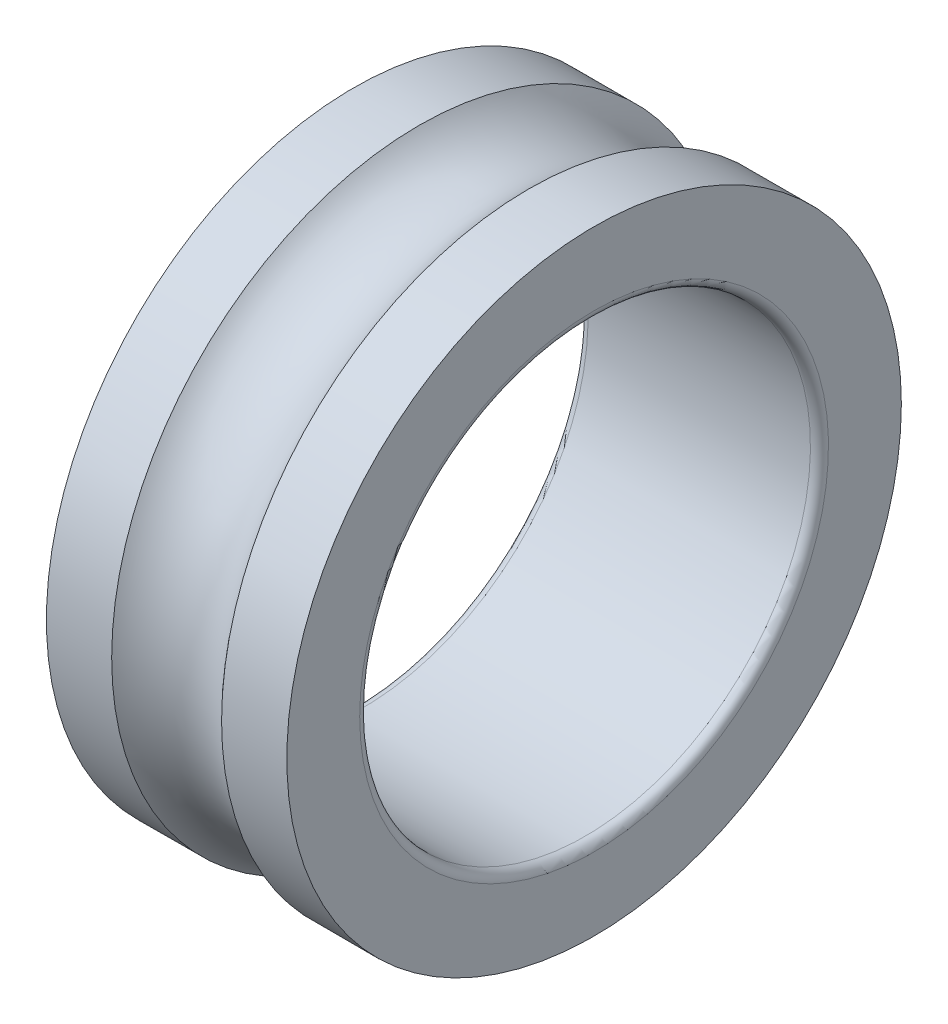
ISO-10303-21;
HEADER;
FILE_DESCRIPTION(('STEP AP214'),'2;1');
FILE_NAME('part.step','',(''),(''),'','','');
FILE_SCHEMA(('AUTOMOTIVE_DESIGN { 1 0 10303 214 1 1 1 1 }'));
ENDSEC;
DATA;
#1=APPLICATION_CONTEXT('core data for automotive mechanical design processes');
#2=APPLICATION_PROTOCOL_DEFINITION('international standard','automotive_design',2000,#1);
#3=PRODUCT_CONTEXT('',#1,'mechanical');
#4=PRODUCT('Part','Part','',(#3));
#5=PRODUCT_RELATED_PRODUCT_CATEGORY('part','',(#4));
#6=PRODUCT_DEFINITION_FORMATION('','',#4);
#7=PRODUCT_DEFINITION_CONTEXT('part definition',#1,'design');
#8=PRODUCT_DEFINITION('design','',#6,#7);
#9=PRODUCT_DEFINITION_SHAPE('','',#8);
#10=(LENGTH_UNIT() NAMED_UNIT(*) SI_UNIT(.MILLI.,.METRE.));
#11=(NAMED_UNIT(*) PLANE_ANGLE_UNIT() SI_UNIT($,.RADIAN.));
#12=(NAMED_UNIT(*) SI_UNIT($,.STERADIAN.) SOLID_ANGLE_UNIT());
#13=UNCERTAINTY_MEASURE_WITH_UNIT(LENGTH_MEASURE(1.E-05),#10,'distance_accuracy_value','');
#14=(GEOMETRIC_REPRESENTATION_CONTEXT(3) GLOBAL_UNCERTAINTY_ASSIGNED_CONTEXT((#13)) GLOBAL_UNIT_ASSIGNED_CONTEXT((#10,
#11,#12)) REPRESENTATION_CONTEXT('',''));
#15=CARTESIAN_POINT('',(0.,0.,0.));
#16=DIRECTION('',(0.,0.,1.));
#17=DIRECTION('',(1.,0.,0.));
#18=AXIS2_PLACEMENT_3D('',#15,#16,#17);
#19=CARTESIAN_POINT('',(0.3,0.,0.));
#20=DIRECTION('',(1.,0.,0.));
#21=DIRECTION('',(0.,0.,-1.));
#22=AXIS2_PLACEMENT_3D('',#19,#20,#21);
#23=CYLINDRICAL_SURFACE('',#22,7.5);
#24=CARTESIAN_POINT('',(0.3,0.,0.));
#25=DIRECTION('',(1.,0.,0.));
#26=DIRECTION('',(0.,1.,0.));
#27=AXIS2_PLACEMENT_3D('',#24,#25,#26);
#28=CIRCLE('',#27,7.5);
#29=CARTESIAN_POINT('',(0.3,7.5,0.));
#30=VERTEX_POINT('',#29);
#31=EDGE_CURVE('E67',#30,#30,#28,.T.);
#32=ORIENTED_EDGE('',*,*,#31,.F.);
#33=EDGE_LOOP('',(#32));
#34=FACE_BOUND('',#33,.T.);
#35=CARTESIAN_POINT('',(7.7,0.,0.));
#36=DIRECTION('',(1.,0.,0.));
#37=DIRECTION('',(0.,1.,0.));
#38=AXIS2_PLACEMENT_3D('',#35,#36,#37);
#39=CIRCLE('',#38,7.5);
#40=CARTESIAN_POINT('',(7.7,7.5,0.));
#41=VERTEX_POINT('',#40);
#42=EDGE_CURVE('E70',#41,#41,#39,.F.);
#43=ORIENTED_EDGE('',*,*,#42,.F.);
#44=EDGE_LOOP('',(#43));
#45=FACE_BOUND('',#44,.T.);
#46=ADVANCED_FACE('F13',(#34,#45),#23,.F.);
#47=CARTESIAN_POINT('',(7.7,0.,0.));
#48=DIRECTION('',(1.,0.,0.));
#49=DIRECTION('',(0.,1.,0.));
#50=AXIS2_PLACEMENT_3D('',#47,#48,#49);
#51=TOROIDAL_SURFACE('',#50,7.8,0.300000000000001);
#52=CARTESIAN_POINT('',(8.,0.,0.));
#53=DIRECTION('',(1.,0.,0.));
#54=DIRECTION('',(0.,0.,1.));
#55=AXIS2_PLACEMENT_3D('',#52,#53,#54);
#56=CIRCLE('',#55,7.8);
#57=CARTESIAN_POINT('',(8.,0.,7.8));
#58=VERTEX_POINT('',#57);
#59=EDGE_CURVE('E37',#58,#58,#56,.F.);
#60=ORIENTED_EDGE('',*,*,#59,.F.);
#61=EDGE_LOOP('',(#60));
#62=FACE_BOUND('',#61,.T.);
#63=ORIENTED_EDGE('',*,*,#42,.T.);
#64=EDGE_LOOP('',(#63));
#65=FACE_BOUND('',#64,.T.);
#66=ADVANCED_FACE('F59',(#62,#65),#51,.T.);
#67=CARTESIAN_POINT('',(0.3,0.,0.));
#68=DIRECTION('',(1.,0.,0.));
#69=DIRECTION('',(0.,1.,0.));
#70=AXIS2_PLACEMENT_3D('',#67,#68,#69);
#71=TOROIDAL_SURFACE('',#70,7.8,0.3);
#72=ORIENTED_EDGE('',*,*,#31,.T.);
#73=EDGE_LOOP('',(#72));
#74=FACE_BOUND('',#73,.T.);
#75=CARTESIAN_POINT('',(0.,0.,0.));
#76=DIRECTION('',(-1.,0.,0.));
#77=DIRECTION('',(0.,0.,1.));
#78=AXIS2_PLACEMENT_3D('',#75,#76,#77);
#79=CIRCLE('',#78,7.8);
#80=CARTESIAN_POINT('',(0.,0.,7.8));
#81=VERTEX_POINT('',#80);
#82=EDGE_CURVE('E74',#81,#81,#79,.F.);
#83=ORIENTED_EDGE('',*,*,#82,.F.);
#84=EDGE_LOOP('',(#83));
#85=FACE_BOUND('',#84,.T.);
#86=ADVANCED_FACE('F52',(#74,#85),#71,.T.);
#87=CARTESIAN_POINT('',(8.,0.,9.01250025));
#88=DIRECTION('',(1.,0.,0.));
#89=DIRECTION('',(0.,0.,-1.));
#90=AXIS2_PLACEMENT_3D('',#87,#88,#89);
#91=PLANE('',#90);
#92=CARTESIAN_POINT('',(8.,0.,0.));
#93=DIRECTION('',(1.,0.,0.));
#94=DIRECTION('',(0.,0.,-1.));
#95=AXIS2_PLACEMENT_3D('',#92,#93,#94);
#96=CIRCLE('',#95,10.2250005);
#97=CARTESIAN_POINT('',(8.,0.,-10.2250005));
#98=VERTEX_POINT('',#97);
#99=EDGE_CURVE('E16',#98,#98,#96,.F.);
#100=ORIENTED_EDGE('',*,*,#99,.F.);
#101=EDGE_LOOP('',(#100));
#102=FACE_BOUND('',#101,.T.);
#103=ORIENTED_EDGE('',*,*,#59,.T.);
#104=EDGE_LOOP('',(#103));
#105=FACE_BOUND('',#104,.T.);
#106=ADVANCED_FACE('F42',(#102,#105),#91,.T.);
#107=CARTESIAN_POINT('',(0.,0.,9.01250025));
#108=DIRECTION('',(-1.,0.,0.));
#109=DIRECTION('',(0.,0.,1.));
#110=AXIS2_PLACEMENT_3D('',#107,#108,#109);
#111=PLANE('',#110);
#112=ORIENTED_EDGE('',*,*,#82,.T.);
#113=EDGE_LOOP('',(#112));
#114=FACE_BOUND('',#113,.T.);
#115=CARTESIAN_POINT('',(0.,0.,0.));
#116=DIRECTION('',(1.,0.,0.));
#117=DIRECTION('',(0.,0.,-1.));
#118=AXIS2_PLACEMENT_3D('',#115,#116,#117);
#119=CIRCLE('',#118,10.2250005);
#120=CARTESIAN_POINT('',(0.,0.,-10.2250005));
#121=VERTEX_POINT('',#120);
#122=EDGE_CURVE('E25',#121,#121,#119,.T.);
#123=ORIENTED_EDGE('',*,*,#122,.F.);
#124=EDGE_LOOP('',(#123));
#125=FACE_BOUND('',#124,.T.);
#126=ADVANCED_FACE('F51',(#114,#125),#111,.T.);
#127=CARTESIAN_POINT('',(6.91426712795,0.,0.));
#128=DIRECTION('',(1.,0.,0.));
#129=DIRECTION('',(0.,0.,-1.));
#130=AXIS2_PLACEMENT_3D('',#127,#128,#129);
#131=CYLINDRICAL_SURFACE('',#130,10.2250005);
#132=ORIENTED_EDGE('',*,*,#99,.T.);
#133=EDGE_LOOP('',(#132));
#134=FACE_BOUND('',#133,.T.);
#135=CARTESIAN_POINT('',(5.8285342559,0.,0.));
#136=DIRECTION('',(1.,0.,0.));
#137=DIRECTION('',(0.,1.,0.));
#138=AXIS2_PLACEMENT_3D('',#135,#136,#137);
#139=CIRCLE('',#138,10.2250005);
#140=CARTESIAN_POINT('',(5.8285342559,10.2250005,0.));
#141=VERTEX_POINT('',#140);
#142=EDGE_CURVE('E20',#141,#141,#139,.F.);
#143=ORIENTED_EDGE('',*,*,#142,.F.);
#144=EDGE_LOOP('',(#143));
#145=FACE_BOUND('',#144,.T.);
#146=ADVANCED_FACE('F111',(#134,#145),#131,.T.);
#147=CARTESIAN_POINT('',(1.08573287205,0.,0.));
#148=DIRECTION('',(1.,0.,0.));
#149=DIRECTION('',(0.,0.,-1.));
#150=AXIS2_PLACEMENT_3D('',#147,#148,#149);
#151=CYLINDRICAL_SURFACE('',#150,10.2250005);
#152=CARTESIAN_POINT('',(2.1714657441,0.,0.));
#153=DIRECTION('',(1.,0.,0.));
#154=DIRECTION('',(0.,1.,0.));
#155=AXIS2_PLACEMENT_3D('',#152,#153,#154);
#156=CIRCLE('',#155,10.2250005);
#157=CARTESIAN_POINT('',(2.1714657441,10.2250005,0.));
#158=VERTEX_POINT('',#157);
#159=EDGE_CURVE('E9',#158,#158,#156,.T.);
#160=ORIENTED_EDGE('',*,*,#159,.F.);
#161=EDGE_LOOP('',(#160));
#162=FACE_BOUND('',#161,.T.);
#163=ORIENTED_EDGE('',*,*,#122,.T.);
#164=EDGE_LOOP('',(#163));
#165=FACE_BOUND('',#164,.T.);
#166=ADVANCED_FACE('F109',(#162,#165),#151,.T.);
#167=CARTESIAN_POINT('',(4.,0.,0.));
#168=DIRECTION('',(1.,0.,0.));
#169=DIRECTION('',(0.,1.,0.));
#170=AXIS2_PLACEMENT_3D('',#167,#168,#169);
#171=TOROIDAL_SURFACE('',#170,11.75,2.381);
#172=ORIENTED_EDGE('',*,*,#159,.T.);
#173=EDGE_LOOP('',(#172));
#174=FACE_BOUND('',#173,.T.);
#175=ORIENTED_EDGE('',*,*,#142,.T.);
#176=EDGE_LOOP('',(#175));
#177=FACE_BOUND('',#176,.T.);
#178=ADVANCED_FACE('F106',(#174,#177),#171,.F.);
#179=CLOSED_SHELL('',(#46,#66,#86,#106,#126,#146,#166,#178));
#180=MANIFOLD_SOLID_BREP('B1',#179);
#181=ADVANCED_BREP_SHAPE_REPRESENTATION('',(#18,#180),#14);
#182=SHAPE_DEFINITION_REPRESENTATION(#9,#181);
ENDSEC;
END-ISO-10303-21;
